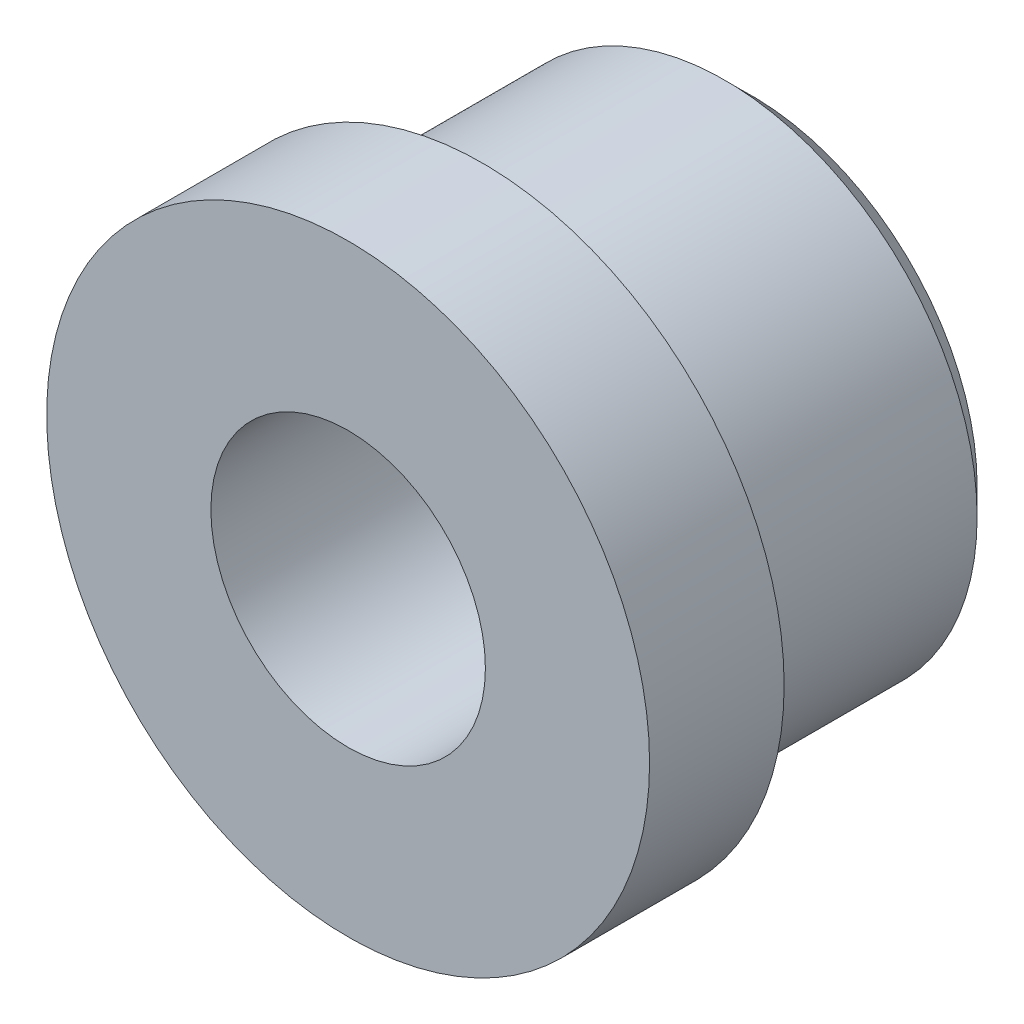
ISO-10303-21;
HEADER;
FILE_DESCRIPTION(('STEP AP214'),'2;1');
FILE_NAME('part.step','',(''),(''),'','','');
FILE_SCHEMA(('AUTOMOTIVE_DESIGN { 1 0 10303 214 1 1 1 1 }'));
ENDSEC;
DATA;
#1=APPLICATION_CONTEXT('core data for automotive mechanical design processes');
#2=APPLICATION_PROTOCOL_DEFINITION('international standard','automotive_design',2000,#1);
#3=PRODUCT_CONTEXT('',#1,'mechanical');
#4=PRODUCT('Part','Part','',(#3));
#5=PRODUCT_RELATED_PRODUCT_CATEGORY('part','',(#4));
#6=PRODUCT_DEFINITION_FORMATION('','',#4);
#7=PRODUCT_DEFINITION_CONTEXT('part definition',#1,'design');
#8=PRODUCT_DEFINITION('design','',#6,#7);
#9=PRODUCT_DEFINITION_SHAPE('','',#8);
#10=(LENGTH_UNIT() NAMED_UNIT(*) SI_UNIT(.MILLI.,.METRE.));
#11=(NAMED_UNIT(*) PLANE_ANGLE_UNIT() SI_UNIT($,.RADIAN.));
#12=(NAMED_UNIT(*) SI_UNIT($,.STERADIAN.) SOLID_ANGLE_UNIT());
#13=UNCERTAINTY_MEASURE_WITH_UNIT(LENGTH_MEASURE(1.E-05),#10,'distance_accuracy_value','');
#14=(GEOMETRIC_REPRESENTATION_CONTEXT(3) GLOBAL_UNCERTAINTY_ASSIGNED_CONTEXT((#13)) GLOBAL_UNIT_ASSIGNED_CONTEXT((#10,
#11,#12)) REPRESENTATION_CONTEXT('',''));
#15=CARTESIAN_POINT('',(0.,0.,0.));
#16=DIRECTION('',(0.,0.,1.));
#17=DIRECTION('',(1.,0.,0.));
#18=AXIS2_PLACEMENT_3D('',#15,#16,#17);
#19=CARTESIAN_POINT('',(0.,0.,-48.1449652892561));
#20=DIRECTION('',(0.,0.,1.));
#21=DIRECTION('',(1.,0.,0.));
#22=AXIS2_PLACEMENT_3D('',#19,#20,#21);
#23=CYLINDRICAL_SURFACE('',#22,11.8999);
#24=CARTESIAN_POINT('',(0.,0.,-46.8749652892561));
#25=DIRECTION('',(0.,0.,1.));
#26=DIRECTION('',(1.,0.,0.));
#27=AXIS2_PLACEMENT_3D('',#24,#25,#26);
#28=CIRCLE('',#27,11.8999);
#29=CARTESIAN_POINT('',(11.8999,0.,-46.8749652892561));
#30=VERTEX_POINT('',#29);
#31=EDGE_CURVE('E41',#30,#30,#28,.F.);
#32=ORIENTED_EDGE('',*,*,#31,.F.);
#33=EDGE_LOOP('',(#32));
#34=FACE_BOUND('',#33,.T.);
#35=CARTESIAN_POINT('',(0.,0.,-36.7149652892561));
#36=DIRECTION('',(0.,0.,-1.));
#37=DIRECTION('',(-1.,0.,0.));
#38=AXIS2_PLACEMENT_3D('',#35,#36,#37);
#39=CIRCLE('',#38,11.8999);
#40=CARTESIAN_POINT('',(-11.8999,0.,-36.7149652892561));
#41=VERTEX_POINT('',#40);
#42=EDGE_CURVE('E29',#41,#41,#39,.F.);
#43=ORIENTED_EDGE('',*,*,#42,.F.);
#44=EDGE_LOOP('',(#43));
#45=FACE_BOUND('',#44,.T.);
#46=ADVANCED_FACE('F14',(#34,#45),#23,.T.);
#47=CARTESIAN_POINT('',(0.,0.,-36.7149652892561));
#48=DIRECTION('',(0.,0.,-1.));
#49=DIRECTION('',(-1.,0.,0.));
#50=AXIS2_PLACEMENT_3D('',#47,#48,#49);
#51=CONICAL_SURFACE('',#50,11.8999,0.785398163397448);
#52=ORIENTED_EDGE('',*,*,#42,.T.);
#53=EDGE_LOOP('',(#52));
#54=FACE_BOUND('',#53,.T.);
#55=CARTESIAN_POINT('',(0.,0.,-35.4449652892561));
#56=DIRECTION('',(0.,0.,-1.));
#57=DIRECTION('',(-1.,0.,0.));
#58=AXIS2_PLACEMENT_3D('',#55,#56,#57);
#59=CIRCLE('',#58,10.6299);
#60=CARTESIAN_POINT('',(-10.6299,0.,-35.4449652892561));
#61=VERTEX_POINT('',#60);
#62=EDGE_CURVE('E17',#61,#61,#59,.F.);
#63=ORIENTED_EDGE('',*,*,#62,.F.);
#64=EDGE_LOOP('',(#63));
#65=FACE_BOUND('',#64,.T.);
#66=ADVANCED_FACE('F50',(#54,#65),#51,.T.);
#67=CARTESIAN_POINT('',(0.,0.,-46.8749652892561));
#68=DIRECTION('',(0.,0.,1.));
#69=DIRECTION('',(1.,0.,0.));
#70=AXIS2_PLACEMENT_3D('',#67,#68,#69);
#71=CONICAL_SURFACE('',#70,11.8999,0.785398163397446);
#72=CARTESIAN_POINT('',(0.,0.,-48.1449652892561));
#73=DIRECTION('',(0.,0.,1.));
#74=DIRECTION('',(1.,0.,0.));
#75=AXIS2_PLACEMENT_3D('',#72,#73,#74);
#76=CIRCLE('',#75,10.6299);
#77=CARTESIAN_POINT('',(10.6299,0.,-48.1449652892561));
#78=VERTEX_POINT('',#77);
#79=EDGE_CURVE('E36',#78,#78,#76,.F.);
#80=ORIENTED_EDGE('',*,*,#79,.F.);
#81=EDGE_LOOP('',(#80));
#82=FACE_BOUND('',#81,.T.);
#83=ORIENTED_EDGE('',*,*,#31,.T.);
#84=EDGE_LOOP('',(#83));
#85=FACE_BOUND('',#84,.T.);
#86=ADVANCED_FACE('F59',(#82,#85),#71,.T.);
#87=CARTESIAN_POINT('',(14.224,0.,-35.4449652892561));
#88=DIRECTION('',(0.,0.,-1.));
#89=DIRECTION('',(-1.,0.,0.));
#90=AXIS2_PLACEMENT_3D('',#87,#88,#89);
#91=PLANE('',#90);
#92=CARTESIAN_POINT('',(0.,0.,-35.4449652892561));
#93=DIRECTION('',(0.,0.,1.));
#94=DIRECTION('',(1.,0.,0.));
#95=AXIS2_PLACEMENT_3D('',#92,#93,#94);
#96=CIRCLE('',#95,14.224);
#97=CARTESIAN_POINT('',(14.224,0.,-35.4449652892561));
#98=VERTEX_POINT('',#97);
#99=EDGE_CURVE('E34',#98,#98,#96,.T.);
#100=ORIENTED_EDGE('',*,*,#99,.F.);
#101=EDGE_LOOP('',(#100));
#102=FACE_BOUND('',#101,.T.);
#103=ORIENTED_EDGE('',*,*,#62,.T.);
#104=EDGE_LOOP('',(#103));
#105=FACE_BOUND('',#104,.T.);
#106=ADVANCED_FACE('F78',(#102,#105),#91,.T.);
#107=CARTESIAN_POINT('',(10.6299,0.,-48.1449652892561));
#108=DIRECTION('',(0.,0.,-1.));
#109=DIRECTION('',(-1.,0.,0.));
#110=AXIS2_PLACEMENT_3D('',#107,#108,#109);
#111=PLANE('',#110);
#112=ORIENTED_EDGE('',*,*,#79,.T.);
#113=EDGE_LOOP('',(#112));
#114=FACE_BOUND('',#113,.T.);
#115=CARTESIAN_POINT('',(0.,0.,-48.1449652892561));
#116=DIRECTION('',(0.,0.,1.));
#117=DIRECTION('',(1.,0.,0.));
#118=AXIS2_PLACEMENT_3D('',#115,#116,#117);
#119=CIRCLE('',#118,6.477);
#120=CARTESIAN_POINT('',(6.477,0.,-48.1449652892561));
#121=VERTEX_POINT('',#120);
#122=EDGE_CURVE('E26',#121,#121,#119,.T.);
#123=ORIENTED_EDGE('',*,*,#122,.T.);
#124=EDGE_LOOP('',(#123));
#125=FACE_BOUND('',#124,.T.);
#126=ADVANCED_FACE('F74',(#114,#125),#111,.T.);
#127=CARTESIAN_POINT('',(0.,0.,-48.1449652892561));
#128=DIRECTION('',(0.,0.,1.));
#129=DIRECTION('',(1.,0.,0.));
#130=AXIS2_PLACEMENT_3D('',#127,#128,#129);
#131=CYLINDRICAL_SURFACE('',#130,14.224);
#132=ORIENTED_EDGE('',*,*,#99,.T.);
#133=EDGE_LOOP('',(#132));
#134=FACE_BOUND('',#133,.T.);
#135=CARTESIAN_POINT('',(0.,0.,-29.0949652892561));
#136=DIRECTION('',(0.,0.,1.));
#137=DIRECTION('',(1.,0.,0.));
#138=AXIS2_PLACEMENT_3D('',#135,#136,#137);
#139=CIRCLE('',#138,14.224);
#140=CARTESIAN_POINT('',(14.224,0.,-29.0949652892561));
#141=VERTEX_POINT('',#140);
#142=EDGE_CURVE('E21',#141,#141,#139,.T.);
#143=ORIENTED_EDGE('',*,*,#142,.F.);
#144=EDGE_LOOP('',(#143));
#145=FACE_BOUND('',#144,.T.);
#146=ADVANCED_FACE('F67',(#134,#145),#131,.T.);
#147=CARTESIAN_POINT('',(0.,0.,-48.1449652892561));
#148=DIRECTION('',(0.,0.,1.));
#149=DIRECTION('',(1.,0.,0.));
#150=AXIS2_PLACEMENT_3D('',#147,#148,#149);
#151=CYLINDRICAL_SURFACE('',#150,6.477);
#152=CARTESIAN_POINT('',(0.,0.,-29.0949652892561));
#153=DIRECTION('',(0.,0.,1.));
#154=DIRECTION('',(1.,0.,0.));
#155=AXIS2_PLACEMENT_3D('',#152,#153,#154);
#156=CIRCLE('',#155,6.477);
#157=CARTESIAN_POINT('',(6.477,0.,-29.0949652892561));
#158=VERTEX_POINT('',#157);
#159=EDGE_CURVE('E10',#158,#158,#156,.F.);
#160=ORIENTED_EDGE('',*,*,#159,.F.);
#161=EDGE_LOOP('',(#160));
#162=FACE_BOUND('',#161,.T.);
#163=ORIENTED_EDGE('',*,*,#122,.F.);
#164=EDGE_LOOP('',(#163));
#165=FACE_BOUND('',#164,.T.);
#166=ADVANCED_FACE('F62',(#162,#165),#151,.F.);
#167=CARTESIAN_POINT('',(6.477,0.,-29.0949652892561));
#168=DIRECTION('',(0.,0.,1.));
#169=DIRECTION('',(1.,0.,0.));
#170=AXIS2_PLACEMENT_3D('',#167,#168,#169);
#171=PLANE('',#170);
#172=ORIENTED_EDGE('',*,*,#159,.T.);
#173=EDGE_LOOP('',(#172));
#174=FACE_BOUND('',#173,.T.);
#175=ORIENTED_EDGE('',*,*,#142,.T.);
#176=EDGE_LOOP('',(#175));
#177=FACE_BOUND('',#176,.T.);
#178=ADVANCED_FACE('F60',(#174,#177),#171,.T.);
#179=CLOSED_SHELL('',(#46,#66,#86,#106,#126,#146,#166,#178));
#180=MANIFOLD_SOLID_BREP('B1',#179);
#181=ADVANCED_BREP_SHAPE_REPRESENTATION('',(#18,#180),#14);
#182=SHAPE_DEFINITION_REPRESENTATION(#9,#181);
ENDSEC;
END-ISO-10303-21;
